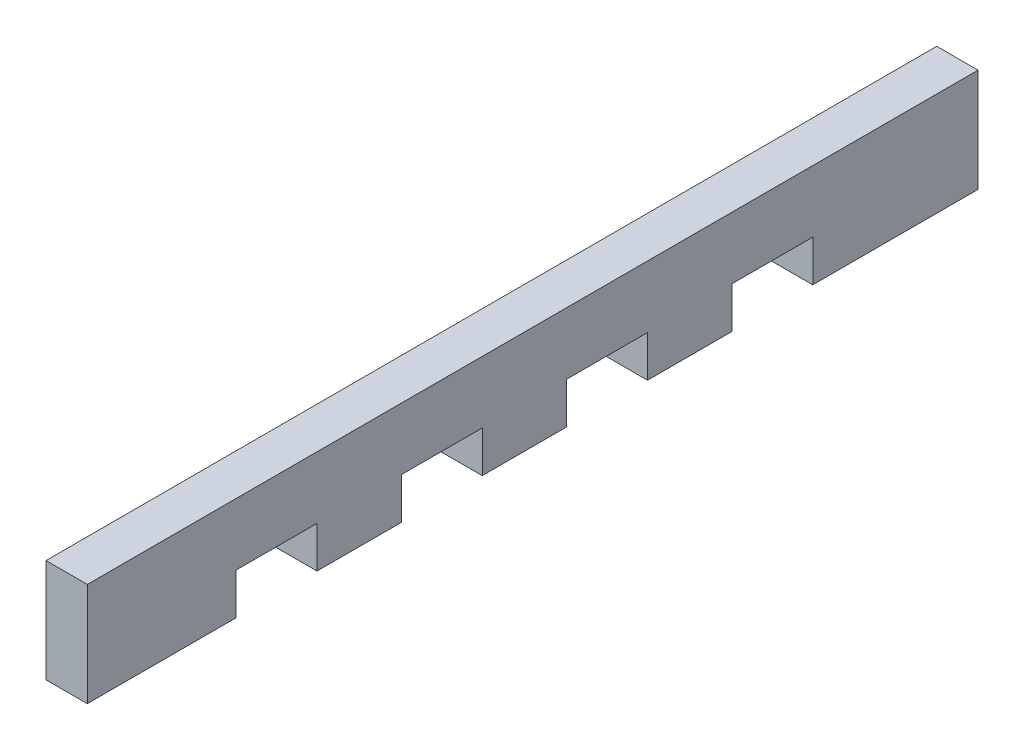
ISO-10303-21;
HEADER;
FILE_DESCRIPTION(('STEP AP214'),'2;1');
FILE_NAME('part.step','',(''),(''),'','','');
FILE_SCHEMA(('AUTOMOTIVE_DESIGN { 1 0 10303 214 1 1 1 1 }'));
ENDSEC;
DATA;
#1=APPLICATION_CONTEXT('core data for automotive mechanical design processes');
#2=APPLICATION_PROTOCOL_DEFINITION('international standard','automotive_design',2000,#1);
#3=PRODUCT_CONTEXT('',#1,'mechanical');
#4=PRODUCT('Part','Part','',(#3));
#5=PRODUCT_RELATED_PRODUCT_CATEGORY('part','',(#4));
#6=PRODUCT_DEFINITION_FORMATION('','',#4);
#7=PRODUCT_DEFINITION_CONTEXT('part definition',#1,'design');
#8=PRODUCT_DEFINITION('design','',#6,#7);
#9=PRODUCT_DEFINITION_SHAPE('','',#8);
#10=(LENGTH_UNIT() NAMED_UNIT(*) SI_UNIT(.MILLI.,.METRE.));
#11=(NAMED_UNIT(*) PLANE_ANGLE_UNIT() SI_UNIT($,.RADIAN.));
#12=(NAMED_UNIT(*) SI_UNIT($,.STERADIAN.) SOLID_ANGLE_UNIT());
#13=UNCERTAINTY_MEASURE_WITH_UNIT(LENGTH_MEASURE(1.E-05),#10,'distance_accuracy_value','');
#14=(GEOMETRIC_REPRESENTATION_CONTEXT(3) GLOBAL_UNCERTAINTY_ASSIGNED_CONTEXT((#13)) GLOBAL_UNIT_ASSIGNED_CONTEXT((#10,
#11,#12)) REPRESENTATION_CONTEXT('',''));
#15=CARTESIAN_POINT('',(0.,0.,0.));
#16=DIRECTION('',(0.,0.,1.));
#17=DIRECTION('',(1.,0.,0.));
#18=AXIS2_PLACEMENT_3D('',#15,#16,#17);
#19=CARTESIAN_POINT('',(6.35,15.875,0.));
#20=DIRECTION('',(0.,0.,-1.));
#21=DIRECTION('',(0.,1.,0.));
#22=AXIS2_PLACEMENT_3D('',#19,#20,#21);
#23=PLANE('',#22);
#24=DIRECTION('',(0.,-1.,0.));
#25=VECTOR('',#24,1.);
#26=CARTESIAN_POINT('',(0.,15.875,0.));
#27=LINE('',#26,#25);
#28=CARTESIAN_POINT('',(0.,15.875,0.));
#29=VERTEX_POINT('',#28);
#30=CARTESIAN_POINT('',(0.,0.,0.));
#31=VERTEX_POINT('',#30);
#32=EDGE_CURVE('E203',#29,#31,#27,.T.);
#33=ORIENTED_EDGE('',*,*,#32,.T.);
#34=DIRECTION('',(-1.,0.,0.));
#35=VECTOR('',#34,1.);
#36=CARTESIAN_POINT('',(6.35,0.,0.));
#37=LINE('',#36,#35);
#38=CARTESIAN_POINT('',(6.35,0.,0.));
#39=VERTEX_POINT('',#38);
#40=EDGE_CURVE('E11',#39,#31,#37,.T.);
#41=ORIENTED_EDGE('',*,*,#40,.F.);
#42=DIRECTION('',(0.,-1.,0.));
#43=VECTOR('',#42,1.);
#44=CARTESIAN_POINT('',(6.35,15.875,0.));
#45=LINE('',#44,#43);
#46=CARTESIAN_POINT('',(6.35,15.875,0.));
#47=VERTEX_POINT('',#46);
#48=EDGE_CURVE('E241',#47,#39,#45,.T.);
#49=ORIENTED_EDGE('',*,*,#48,.F.);
#50=DIRECTION('',(-1.,0.,0.));
#51=VECTOR('',#50,1.);
#52=CARTESIAN_POINT('',(6.35,15.875,0.));
#53=LINE('',#52,#51);
#54=EDGE_CURVE('E199',#47,#29,#53,.T.);
#55=ORIENTED_EDGE('',*,*,#54,.T.);
#56=EDGE_LOOP('',(#33,#41,#49,#55));
#57=FACE_BOUND('',#56,.T.);
#58=ADVANCED_FACE('F35',(#57),#23,.F.);
#59=CARTESIAN_POINT('',(6.35,0.,0.));
#60=DIRECTION('',(0.,1.,0.));
#61=DIRECTION('',(0.,0.,1.));
#62=AXIS2_PLACEMENT_3D('',#59,#60,#61);
#63=PLANE('',#62);
#64=DIRECTION('',(0.,0.,-1.));
#65=VECTOR('',#64,1.);
#66=CARTESIAN_POINT('',(0.,0.,0.));
#67=LINE('',#66,#65);
#68=CARTESIAN_POINT('',(0.,0.,-22.86));
#69=VERTEX_POINT('',#68);
#70=EDGE_CURVE('E206',#31,#69,#67,.T.);
#71=ORIENTED_EDGE('',*,*,#70,.T.);
#72=DIRECTION('',(-1.,0.,0.));
#73=VECTOR('',#72,1.);
#74=CARTESIAN_POINT('',(6.35,0.,-22.86));
#75=LINE('',#74,#73);
#76=CARTESIAN_POINT('',(6.35,0.,-22.86));
#77=VERTEX_POINT('',#76);
#78=EDGE_CURVE('E43',#77,#69,#75,.T.);
#79=ORIENTED_EDGE('',*,*,#78,.F.);
#80=DIRECTION('',(0.,0.,-1.));
#81=VECTOR('',#80,1.);
#82=CARTESIAN_POINT('',(6.35,0.,0.));
#83=LINE('',#82,#81);
#84=EDGE_CURVE('E130',#39,#77,#83,.T.);
#85=ORIENTED_EDGE('',*,*,#84,.F.);
#86=ORIENTED_EDGE('',*,*,#40,.T.);
#87=EDGE_LOOP('',(#71,#79,#85,#86));
#88=FACE_BOUND('',#87,.T.);
#89=ADVANCED_FACE('F359',(#88),#63,.F.);
#90=CARTESIAN_POINT('',(6.35,0.,-22.86));
#91=DIRECTION('',(0.,0.,1.));
#92=DIRECTION('',(1.,0.,0.));
#93=AXIS2_PLACEMENT_3D('',#90,#91,#92);
#94=PLANE('',#93);
#95=DIRECTION('',(0.,1.,0.));
#96=VECTOR('',#95,1.);
#97=CARTESIAN_POINT('',(0.,0.,-22.86));
#98=LINE('',#97,#96);
#99=CARTESIAN_POINT('',(0.,6.35,-22.86));
#100=VERTEX_POINT('',#99);
#101=EDGE_CURVE('E208',#69,#100,#98,.T.);
#102=ORIENTED_EDGE('',*,*,#101,.T.);
#103=DIRECTION('',(-1.,0.,0.));
#104=VECTOR('',#103,1.);
#105=CARTESIAN_POINT('',(6.35,6.35,-22.86));
#106=LINE('',#105,#104);
#107=CARTESIAN_POINT('',(6.35,6.35,-22.86));
#108=VERTEX_POINT('',#107);
#109=EDGE_CURVE('E284',#108,#100,#106,.T.);
#110=ORIENTED_EDGE('',*,*,#109,.F.);
#111=DIRECTION('',(0.,1.,0.));
#112=VECTOR('',#111,1.);
#113=CARTESIAN_POINT('',(6.35,0.,-22.86));
#114=LINE('',#113,#112);
#115=EDGE_CURVE('E292',#77,#108,#114,.T.);
#116=ORIENTED_EDGE('',*,*,#115,.F.);
#117=ORIENTED_EDGE('',*,*,#78,.T.);
#118=EDGE_LOOP('',(#102,#110,#116,#117));
#119=FACE_BOUND('',#118,.T.);
#120=ADVANCED_FACE('F290',(#119),#94,.F.);
#121=CARTESIAN_POINT('',(6.35,6.35,-22.86));
#122=DIRECTION('',(0.,1.,0.));
#123=DIRECTION('',(0.,0.,1.));
#124=AXIS2_PLACEMENT_3D('',#121,#122,#123);
#125=PLANE('',#124);
#126=DIRECTION('',(0.,0.,-1.));
#127=VECTOR('',#126,1.);
#128=CARTESIAN_POINT('',(0.,6.35,-22.86));
#129=LINE('',#128,#127);
#130=CARTESIAN_POINT('',(0.,6.35,-35.306));
#131=VERTEX_POINT('',#130);
#132=EDGE_CURVE('E210',#100,#131,#129,.T.);
#133=ORIENTED_EDGE('',*,*,#132,.T.);
#134=DIRECTION('',(-1.,0.,0.));
#135=VECTOR('',#134,1.);
#136=CARTESIAN_POINT('',(6.35,6.35,-35.306));
#137=LINE('',#136,#135);
#138=CARTESIAN_POINT('',(6.35,6.35,-35.306));
#139=VERTEX_POINT('',#138);
#140=EDGE_CURVE('E281',#139,#131,#137,.T.);
#141=ORIENTED_EDGE('',*,*,#140,.F.);
#142=DIRECTION('',(0.,0.,-1.));
#143=VECTOR('',#142,1.);
#144=CARTESIAN_POINT('',(6.35,6.35,-22.86));
#145=LINE('',#144,#143);
#146=EDGE_CURVE('E310',#108,#139,#145,.T.);
#147=ORIENTED_EDGE('',*,*,#146,.F.);
#148=ORIENTED_EDGE('',*,*,#109,.T.);
#149=EDGE_LOOP('',(#133,#141,#147,#148));
#150=FACE_BOUND('',#149,.T.);
#151=ADVANCED_FACE('F301',(#150),#125,.F.);
#152=CARTESIAN_POINT('',(6.35,6.35,-35.306));
#153=DIRECTION('',(0.,0.,-1.));
#154=DIRECTION('',(-1.,0.,0.));
#155=AXIS2_PLACEMENT_3D('',#152,#153,#154);
#156=PLANE('',#155);
#157=DIRECTION('',(0.,-1.,0.));
#158=VECTOR('',#157,1.);
#159=CARTESIAN_POINT('',(0.,6.35,-35.306));
#160=LINE('',#159,#158);
#161=CARTESIAN_POINT('',(0.,0.,-35.306));
#162=VERTEX_POINT('',#161);
#163=EDGE_CURVE('E212',#131,#162,#160,.T.);
#164=ORIENTED_EDGE('',*,*,#163,.T.);
#165=DIRECTION('',(-1.,0.,0.));
#166=VECTOR('',#165,1.);
#167=CARTESIAN_POINT('',(6.35,0.,-35.306));
#168=LINE('',#167,#166);
#169=CARTESIAN_POINT('',(6.35,0.,-35.306));
#170=VERTEX_POINT('',#169);
#171=EDGE_CURVE('E278',#170,#162,#168,.T.);
#172=ORIENTED_EDGE('',*,*,#171,.F.);
#173=DIRECTION('',(0.,-1.,0.));
#174=VECTOR('',#173,1.);
#175=CARTESIAN_POINT('',(6.35,6.35,-35.306));
#176=LINE('',#175,#174);
#177=EDGE_CURVE('E307',#139,#170,#176,.T.);
#178=ORIENTED_EDGE('',*,*,#177,.F.);
#179=ORIENTED_EDGE('',*,*,#140,.T.);
#180=EDGE_LOOP('',(#164,#172,#178,#179));
#181=FACE_BOUND('',#180,.T.);
#182=ADVANCED_FACE('F305',(#181),#156,.F.);
#183=CARTESIAN_POINT('',(6.35,0.,-35.306));
#184=DIRECTION('',(0.,1.,0.));
#185=DIRECTION('',(0.,0.,1.));
#186=AXIS2_PLACEMENT_3D('',#183,#184,#185);
#187=PLANE('',#186);
#188=DIRECTION('',(0.,0.,-1.));
#189=VECTOR('',#188,1.);
#190=CARTESIAN_POINT('',(0.,0.,-35.306));
#191=LINE('',#190,#189);
#192=CARTESIAN_POINT('',(0.,0.,-48.26));
#193=VERTEX_POINT('',#192);
#194=EDGE_CURVE('E214',#162,#193,#191,.T.);
#195=ORIENTED_EDGE('',*,*,#194,.T.);
#196=DIRECTION('',(-1.,0.,0.));
#197=VECTOR('',#196,1.);
#198=CARTESIAN_POINT('',(6.35,0.,-48.26));
#199=LINE('',#198,#197);
#200=CARTESIAN_POINT('',(6.35,0.,-48.26));
#201=VERTEX_POINT('',#200);
#202=EDGE_CURVE('E275',#201,#193,#199,.T.);
#203=ORIENTED_EDGE('',*,*,#202,.F.);
#204=DIRECTION('',(0.,0.,-1.));
#205=VECTOR('',#204,1.);
#206=CARTESIAN_POINT('',(6.35,0.,-35.306));
#207=LINE('',#206,#205);
#208=EDGE_CURVE('E309',#170,#201,#207,.T.);
#209=ORIENTED_EDGE('',*,*,#208,.F.);
#210=ORIENTED_EDGE('',*,*,#171,.T.);
#211=EDGE_LOOP('',(#195,#203,#209,#210));
#212=FACE_BOUND('',#211,.T.);
#213=ADVANCED_FACE('F372',(#212),#187,.F.);
#214=CARTESIAN_POINT('',(6.35,0.,-48.26));
#215=DIRECTION('',(0.,0.,1.));
#216=DIRECTION('',(1.,0.,0.));
#217=AXIS2_PLACEMENT_3D('',#214,#215,#216);
#218=PLANE('',#217);
#219=DIRECTION('',(0.,1.,0.));
#220=VECTOR('',#219,1.);
#221=CARTESIAN_POINT('',(0.,0.,-48.26));
#222=LINE('',#221,#220);
#223=CARTESIAN_POINT('',(0.,6.35,-48.26));
#224=VERTEX_POINT('',#223);
#225=EDGE_CURVE('E216',#193,#224,#222,.T.);
#226=ORIENTED_EDGE('',*,*,#225,.T.);
#227=DIRECTION('',(-1.,0.,0.));
#228=VECTOR('',#227,1.);
#229=CARTESIAN_POINT('',(6.35,6.35,-48.26));
#230=LINE('',#229,#228);
#231=CARTESIAN_POINT('',(6.35,6.35,-48.26));
#232=VERTEX_POINT('',#231);
#233=EDGE_CURVE('E272',#232,#224,#230,.T.);
#234=ORIENTED_EDGE('',*,*,#233,.F.);
#235=DIRECTION('',(0.,1.,0.));
#236=VECTOR('',#235,1.);
#237=CARTESIAN_POINT('',(6.35,0.,-48.26));
#238=LINE('',#237,#236);
#239=EDGE_CURVE('E312',#201,#232,#238,.T.);
#240=ORIENTED_EDGE('',*,*,#239,.F.);
#241=ORIENTED_EDGE('',*,*,#202,.T.);
#242=EDGE_LOOP('',(#226,#234,#240,#241));
#243=FACE_BOUND('',#242,.T.);
#244=ADVANCED_FACE('F375',(#243),#218,.F.);
#245=CARTESIAN_POINT('',(6.35,6.35,-48.26));
#246=DIRECTION('',(0.,1.,0.));
#247=DIRECTION('',(0.,0.,1.));
#248=AXIS2_PLACEMENT_3D('',#245,#246,#247);
#249=PLANE('',#248);
#250=DIRECTION('',(0.,0.,-1.));
#251=VECTOR('',#250,1.);
#252=CARTESIAN_POINT('',(0.,6.35,-48.26));
#253=LINE('',#252,#251);
#254=CARTESIAN_POINT('',(0.,6.35,-60.706));
#255=VERTEX_POINT('',#254);
#256=EDGE_CURVE('E218',#224,#255,#253,.T.);
#257=ORIENTED_EDGE('',*,*,#256,.T.);
#258=DIRECTION('',(-1.,0.,0.));
#259=VECTOR('',#258,1.);
#260=CARTESIAN_POINT('',(6.35,6.35,-60.706));
#261=LINE('',#260,#259);
#262=CARTESIAN_POINT('',(6.35,6.35,-60.706));
#263=VERTEX_POINT('',#262);
#264=EDGE_CURVE('E269',#263,#255,#261,.T.);
#265=ORIENTED_EDGE('',*,*,#264,.F.);
#266=DIRECTION('',(0.,0.,-1.));
#267=VECTOR('',#266,1.);
#268=CARTESIAN_POINT('',(6.35,6.35,-48.26));
#269=LINE('',#268,#267);
#270=EDGE_CURVE('E318',#232,#263,#269,.T.);
#271=ORIENTED_EDGE('',*,*,#270,.F.);
#272=ORIENTED_EDGE('',*,*,#233,.T.);
#273=EDGE_LOOP('',(#257,#265,#271,#272));
#274=FACE_BOUND('',#273,.T.);
#275=ADVANCED_FACE('F379',(#274),#249,.F.);
#276=CARTESIAN_POINT('',(6.35,6.35,-60.706));
#277=DIRECTION('',(0.,0.,-1.));
#278=DIRECTION('',(-1.,0.,0.));
#279=AXIS2_PLACEMENT_3D('',#276,#277,#278);
#280=PLANE('',#279);
#281=DIRECTION('',(0.,-1.,0.));
#282=VECTOR('',#281,1.);
#283=CARTESIAN_POINT('',(0.,6.35,-60.706));
#284=LINE('',#283,#282);
#285=CARTESIAN_POINT('',(0.,0.,-60.706));
#286=VERTEX_POINT('',#285);
#287=EDGE_CURVE('E220',#255,#286,#284,.T.);
#288=ORIENTED_EDGE('',*,*,#287,.T.);
#289=DIRECTION('',(-1.,0.,0.));
#290=VECTOR('',#289,1.);
#291=CARTESIAN_POINT('',(6.35,0.,-60.706));
#292=LINE('',#291,#290);
#293=CARTESIAN_POINT('',(6.35,0.,-60.706));
#294=VERTEX_POINT('',#293);
#295=EDGE_CURVE('E266',#294,#286,#292,.T.);
#296=ORIENTED_EDGE('',*,*,#295,.F.);
#297=DIRECTION('',(0.,-1.,0.));
#298=VECTOR('',#297,1.);
#299=CARTESIAN_POINT('',(6.35,6.35,-60.706));
#300=LINE('',#299,#298);
#301=EDGE_CURVE('E320',#263,#294,#300,.T.);
#302=ORIENTED_EDGE('',*,*,#301,.F.);
#303=ORIENTED_EDGE('',*,*,#264,.T.);
#304=EDGE_LOOP('',(#288,#296,#302,#303));
#305=FACE_BOUND('',#304,.T.);
#306=ADVANCED_FACE('F383',(#305),#280,.F.);
#307=CARTESIAN_POINT('',(6.35,0.,-60.706));
#308=DIRECTION('',(0.,1.,0.));
#309=DIRECTION('',(0.,0.,1.));
#310=AXIS2_PLACEMENT_3D('',#307,#308,#309);
#311=PLANE('',#310);
#312=DIRECTION('',(0.,0.,-1.));
#313=VECTOR('',#312,1.);
#314=CARTESIAN_POINT('',(0.,0.,-60.706));
#315=LINE('',#314,#313);
#316=CARTESIAN_POINT('',(0.,0.,-73.66));
#317=VERTEX_POINT('',#316);
#318=EDGE_CURVE('E222',#286,#317,#315,.T.);
#319=ORIENTED_EDGE('',*,*,#318,.T.);
#320=DIRECTION('',(-1.,0.,0.));
#321=VECTOR('',#320,1.);
#322=CARTESIAN_POINT('',(6.35,0.,-73.66));
#323=LINE('',#322,#321);
#324=CARTESIAN_POINT('',(6.35,0.,-73.66));
#325=VERTEX_POINT('',#324);
#326=EDGE_CURVE('E263',#325,#317,#323,.T.);
#327=ORIENTED_EDGE('',*,*,#326,.F.);
#328=DIRECTION('',(0.,0.,-1.));
#329=VECTOR('',#328,1.);
#330=CARTESIAN_POINT('',(6.35,0.,-60.706));
#331=LINE('',#330,#329);
#332=EDGE_CURVE('E322',#294,#325,#331,.T.);
#333=ORIENTED_EDGE('',*,*,#332,.F.);
#334=ORIENTED_EDGE('',*,*,#295,.T.);
#335=EDGE_LOOP('',(#319,#327,#333,#334));
#336=FACE_BOUND('',#335,.T.);
#337=ADVANCED_FACE('F387',(#336),#311,.F.);
#338=CARTESIAN_POINT('',(6.35,0.,-73.66));
#339=DIRECTION('',(0.,0.,1.));
#340=DIRECTION('',(1.,0.,0.));
#341=AXIS2_PLACEMENT_3D('',#338,#339,#340);
#342=PLANE('',#341);
#343=DIRECTION('',(0.,1.,0.));
#344=VECTOR('',#343,1.);
#345=CARTESIAN_POINT('',(0.,0.,-73.66));
#346=LINE('',#345,#344);
#347=CARTESIAN_POINT('',(0.,6.35,-73.66));
#348=VERTEX_POINT('',#347);
#349=EDGE_CURVE('E224',#317,#348,#346,.T.);
#350=ORIENTED_EDGE('',*,*,#349,.T.);
#351=DIRECTION('',(-1.,0.,0.));
#352=VECTOR('',#351,1.);
#353=CARTESIAN_POINT('',(6.35,6.35,-73.66));
#354=LINE('',#353,#352);
#355=CARTESIAN_POINT('',(6.35,6.35,-73.66));
#356=VERTEX_POINT('',#355);
#357=EDGE_CURVE('E260',#356,#348,#354,.T.);
#358=ORIENTED_EDGE('',*,*,#357,.F.);
#359=DIRECTION('',(0.,1.,0.));
#360=VECTOR('',#359,1.);
#361=CARTESIAN_POINT('',(6.35,0.,-73.66));
#362=LINE('',#361,#360);
#363=EDGE_CURVE('E324',#325,#356,#362,.T.);
#364=ORIENTED_EDGE('',*,*,#363,.F.);
#365=ORIENTED_EDGE('',*,*,#326,.T.);
#366=EDGE_LOOP('',(#350,#358,#364,#365));
#367=FACE_BOUND('',#366,.T.);
#368=ADVANCED_FACE('F391',(#367),#342,.F.);
#369=CARTESIAN_POINT('',(6.35,6.35,-73.66));
#370=DIRECTION('',(0.,1.,0.));
#371=DIRECTION('',(0.,0.,1.));
#372=AXIS2_PLACEMENT_3D('',#369,#370,#371);
#373=PLANE('',#372);
#374=DIRECTION('',(0.,0.,-1.));
#375=VECTOR('',#374,1.);
#376=CARTESIAN_POINT('',(0.,6.35,-73.66));
#377=LINE('',#376,#375);
#378=CARTESIAN_POINT('',(0.,6.35,-86.106));
#379=VERTEX_POINT('',#378);
#380=EDGE_CURVE('E226',#348,#379,#377,.T.);
#381=ORIENTED_EDGE('',*,*,#380,.T.);
#382=DIRECTION('',(-1.,0.,0.));
#383=VECTOR('',#382,1.);
#384=CARTESIAN_POINT('',(6.35,6.35,-86.106));
#385=LINE('',#384,#383);
#386=CARTESIAN_POINT('',(6.35,6.35,-86.106));
#387=VERTEX_POINT('',#386);
#388=EDGE_CURVE('E257',#387,#379,#385,.T.);
#389=ORIENTED_EDGE('',*,*,#388,.F.);
#390=DIRECTION('',(0.,0.,-1.));
#391=VECTOR('',#390,1.);
#392=CARTESIAN_POINT('',(6.35,6.35,-73.66));
#393=LINE('',#392,#391);
#394=EDGE_CURVE('E326',#356,#387,#393,.T.);
#395=ORIENTED_EDGE('',*,*,#394,.F.);
#396=ORIENTED_EDGE('',*,*,#357,.T.);
#397=EDGE_LOOP('',(#381,#389,#395,#396));
#398=FACE_BOUND('',#397,.T.);
#399=ADVANCED_FACE('F395',(#398),#373,.F.);
#400=CARTESIAN_POINT('',(6.35,6.35,-86.106));
#401=DIRECTION('',(0.,0.,-1.));
#402=DIRECTION('',(-1.,0.,0.));
#403=AXIS2_PLACEMENT_3D('',#400,#401,#402);
#404=PLANE('',#403);
#405=DIRECTION('',(0.,-1.,0.));
#406=VECTOR('',#405,1.);
#407=CARTESIAN_POINT('',(0.,6.35,-86.106));
#408=LINE('',#407,#406);
#409=CARTESIAN_POINT('',(0.,0.,-86.106));
#410=VERTEX_POINT('',#409);
#411=EDGE_CURVE('E228',#379,#410,#408,.T.);
#412=ORIENTED_EDGE('',*,*,#411,.T.);
#413=DIRECTION('',(-1.,0.,0.));
#414=VECTOR('',#413,1.);
#415=CARTESIAN_POINT('',(6.35,0.,-86.106));
#416=LINE('',#415,#414);
#417=CARTESIAN_POINT('',(6.35,0.,-86.106));
#418=VERTEX_POINT('',#417);
#419=EDGE_CURVE('E254',#418,#410,#416,.T.);
#420=ORIENTED_EDGE('',*,*,#419,.F.);
#421=DIRECTION('',(0.,-1.,0.));
#422=VECTOR('',#421,1.);
#423=CARTESIAN_POINT('',(6.35,6.35,-86.106));
#424=LINE('',#423,#422);
#425=EDGE_CURVE('E328',#387,#418,#424,.T.);
#426=ORIENTED_EDGE('',*,*,#425,.F.);
#427=ORIENTED_EDGE('',*,*,#388,.T.);
#428=EDGE_LOOP('',(#412,#420,#426,#427));
#429=FACE_BOUND('',#428,.T.);
#430=ADVANCED_FACE('F399',(#429),#404,.F.);
#431=CARTESIAN_POINT('',(6.35,0.,-86.106));
#432=DIRECTION('',(0.,1.,0.));
#433=DIRECTION('',(0.,0.,1.));
#434=AXIS2_PLACEMENT_3D('',#431,#432,#433);
#435=PLANE('',#434);
#436=DIRECTION('',(0.,0.,-1.));
#437=VECTOR('',#436,1.);
#438=CARTESIAN_POINT('',(0.,0.,-86.106));
#439=LINE('',#438,#437);
#440=CARTESIAN_POINT('',(0.,0.,-99.06));
#441=VERTEX_POINT('',#440);
#442=EDGE_CURVE('E230',#410,#441,#439,.T.);
#443=ORIENTED_EDGE('',*,*,#442,.T.);
#444=DIRECTION('',(-1.,0.,0.));
#445=VECTOR('',#444,1.);
#446=CARTESIAN_POINT('',(6.35,0.,-99.06));
#447=LINE('',#446,#445);
#448=CARTESIAN_POINT('',(6.35,0.,-99.06));
#449=VERTEX_POINT('',#448);
#450=EDGE_CURVE('E251',#449,#441,#447,.T.);
#451=ORIENTED_EDGE('',*,*,#450,.F.);
#452=DIRECTION('',(0.,0.,-1.));
#453=VECTOR('',#452,1.);
#454=CARTESIAN_POINT('',(6.35,0.,-86.106));
#455=LINE('',#454,#453);
#456=EDGE_CURVE('E330',#418,#449,#455,.T.);
#457=ORIENTED_EDGE('',*,*,#456,.F.);
#458=ORIENTED_EDGE('',*,*,#419,.T.);
#459=EDGE_LOOP('',(#443,#451,#457,#458));
#460=FACE_BOUND('',#459,.T.);
#461=ADVANCED_FACE('F403',(#460),#435,.F.);
#462=CARTESIAN_POINT('',(6.35,0.,-99.06));
#463=DIRECTION('',(0.,0.,1.));
#464=DIRECTION('',(0.,-1.,0.));
#465=AXIS2_PLACEMENT_3D('',#462,#463,#464);
#466=PLANE('',#465);
#467=DIRECTION('',(0.,1.,0.));
#468=VECTOR('',#467,1.);
#469=CARTESIAN_POINT('',(0.,0.,-99.06));
#470=LINE('',#469,#468);
#471=CARTESIAN_POINT('',(0.,6.35,-99.06));
#472=VERTEX_POINT('',#471);
#473=EDGE_CURVE('E232',#441,#472,#470,.T.);
#474=ORIENTED_EDGE('',*,*,#473,.T.);
#475=DIRECTION('',(-1.,0.,0.));
#476=VECTOR('',#475,1.);
#477=CARTESIAN_POINT('',(6.35,6.35,-99.06));
#478=LINE('',#477,#476);
#479=CARTESIAN_POINT('',(6.35,6.35,-99.06));
#480=VERTEX_POINT('',#479);
#481=EDGE_CURVE('E248',#480,#472,#478,.T.);
#482=ORIENTED_EDGE('',*,*,#481,.F.);
#483=DIRECTION('',(0.,1.,0.));
#484=VECTOR('',#483,1.);
#485=CARTESIAN_POINT('',(6.35,0.,-99.06));
#486=LINE('',#485,#484);
#487=EDGE_CURVE('E332',#449,#480,#486,.T.);
#488=ORIENTED_EDGE('',*,*,#487,.F.);
#489=ORIENTED_EDGE('',*,*,#450,.T.);
#490=EDGE_LOOP('',(#474,#482,#488,#489));
#491=FACE_BOUND('',#490,.T.);
#492=ADVANCED_FACE('F407',(#491),#466,.F.);
#493=CARTESIAN_POINT('',(6.35,6.35,-99.06));
#494=DIRECTION('',(0.,1.,0.));
#495=DIRECTION('',(0.,0.,1.));
#496=AXIS2_PLACEMENT_3D('',#493,#494,#495);
#497=PLANE('',#496);
#498=DIRECTION('',(0.,0.,-1.));
#499=VECTOR('',#498,1.);
#500=CARTESIAN_POINT('',(0.,6.35,-99.06));
#501=LINE('',#500,#499);
#502=CARTESIAN_POINT('',(0.,6.35,-111.506));
#503=VERTEX_POINT('',#502);
#504=EDGE_CURVE('E234',#472,#503,#501,.T.);
#505=ORIENTED_EDGE('',*,*,#504,.T.);
#506=DIRECTION('',(-1.,0.,0.));
#507=VECTOR('',#506,1.);
#508=CARTESIAN_POINT('',(6.35,6.35,-111.506));
#509=LINE('',#508,#507);
#510=CARTESIAN_POINT('',(6.35,6.35,-111.506));
#511=VERTEX_POINT('',#510);
#512=EDGE_CURVE('E245',#511,#503,#509,.T.);
#513=ORIENTED_EDGE('',*,*,#512,.F.);
#514=DIRECTION('',(0.,0.,-1.));
#515=VECTOR('',#514,1.);
#516=CARTESIAN_POINT('',(6.35,6.35,-99.06));
#517=LINE('',#516,#515);
#518=EDGE_CURVE('E334',#480,#511,#517,.T.);
#519=ORIENTED_EDGE('',*,*,#518,.F.);
#520=ORIENTED_EDGE('',*,*,#481,.T.);
#521=EDGE_LOOP('',(#505,#513,#519,#520));
#522=FACE_BOUND('',#521,.T.);
#523=ADVANCED_FACE('F340',(#522),#497,.F.);
#524=CARTESIAN_POINT('',(6.35,6.35,-111.506));
#525=DIRECTION('',(0.,0.,-1.));
#526=DIRECTION('',(-1.,0.,0.));
#527=AXIS2_PLACEMENT_3D('',#524,#525,#526);
#528=PLANE('',#527);
#529=DIRECTION('',(0.,-1.,0.));
#530=VECTOR('',#529,1.);
#531=CARTESIAN_POINT('',(0.,6.35,-111.506));
#532=LINE('',#531,#530);
#533=CARTESIAN_POINT('',(0.,0.,-111.506));
#534=VERTEX_POINT('',#533);
#535=EDGE_CURVE('E236',#503,#534,#532,.T.);
#536=ORIENTED_EDGE('',*,*,#535,.T.);
#537=DIRECTION('',(-1.,0.,0.));
#538=VECTOR('',#537,1.);
#539=CARTESIAN_POINT('',(6.35,0.,-111.506));
#540=LINE('',#539,#538);
#541=CARTESIAN_POINT('',(6.35,0.,-111.506));
#542=VERTEX_POINT('',#541);
#543=EDGE_CURVE('E194',#542,#534,#540,.T.);
#544=ORIENTED_EDGE('',*,*,#543,.F.);
#545=DIRECTION('',(0.,-1.,0.));
#546=VECTOR('',#545,1.);
#547=CARTESIAN_POINT('',(6.35,6.35,-111.506));
#548=LINE('',#547,#546);
#549=EDGE_CURVE('E185',#511,#542,#548,.T.);
#550=ORIENTED_EDGE('',*,*,#549,.F.);
#551=ORIENTED_EDGE('',*,*,#512,.T.);
#552=EDGE_LOOP('',(#536,#544,#550,#551));
#553=FACE_BOUND('',#552,.T.);
#554=ADVANCED_FACE('F344',(#553),#528,.F.);
#555=CARTESIAN_POINT('',(6.35,0.,-111.506));
#556=DIRECTION('',(0.,1.,0.));
#557=DIRECTION('',(0.,0.,1.));
#558=AXIS2_PLACEMENT_3D('',#555,#556,#557);
#559=PLANE('',#558);
#560=DIRECTION('',(0.,0.,-1.));
#561=VECTOR('',#560,1.);
#562=CARTESIAN_POINT('',(0.,0.,-111.506));
#563=LINE('',#562,#561);
#564=CARTESIAN_POINT('',(0.,0.,-136.906));
#565=VERTEX_POINT('',#564);
#566=EDGE_CURVE('E193',#534,#565,#563,.T.);
#567=ORIENTED_EDGE('',*,*,#566,.T.);
#568=DIRECTION('',(-1.,0.,0.));
#569=VECTOR('',#568,1.);
#570=CARTESIAN_POINT('',(6.35,0.,-136.906));
#571=LINE('',#570,#569);
#572=CARTESIAN_POINT('',(6.35,0.,-136.906));
#573=VERTEX_POINT('',#572);
#574=EDGE_CURVE('E190',#573,#565,#571,.T.);
#575=ORIENTED_EDGE('',*,*,#574,.F.);
#576=DIRECTION('',(0.,0.,-1.));
#577=VECTOR('',#576,1.);
#578=CARTESIAN_POINT('',(6.35,0.,-111.506));
#579=LINE('',#578,#577);
#580=EDGE_CURVE('E179',#542,#573,#579,.T.);
#581=ORIENTED_EDGE('',*,*,#580,.F.);
#582=ORIENTED_EDGE('',*,*,#543,.T.);
#583=EDGE_LOOP('',(#567,#575,#581,#582));
#584=FACE_BOUND('',#583,.T.);
#585=ADVANCED_FACE('F191',(#584),#559,.F.);
#586=CARTESIAN_POINT('',(6.35,0.,-136.906));
#587=DIRECTION('',(0.,0.,1.));
#588=DIRECTION('',(1.,0.,0.));
#589=AXIS2_PLACEMENT_3D('',#586,#587,#588);
#590=PLANE('',#589);
#591=DIRECTION('',(0.,1.,0.));
#592=VECTOR('',#591,1.);
#593=CARTESIAN_POINT('',(0.,0.,-136.906));
#594=LINE('',#593,#592);
#595=CARTESIAN_POINT('',(0.,15.875,-136.906));
#596=VERTEX_POINT('',#595);
#597=EDGE_CURVE('E116',#565,#596,#594,.T.);
#598=ORIENTED_EDGE('',*,*,#597,.T.);
#599=DIRECTION('',(-1.,0.,0.));
#600=VECTOR('',#599,1.);
#601=CARTESIAN_POINT('',(6.35,15.875,-136.906));
#602=LINE('',#601,#600);
#603=CARTESIAN_POINT('',(6.35,15.875,-136.906));
#604=VERTEX_POINT('',#603);
#605=EDGE_CURVE('E195',#604,#596,#602,.T.);
#606=ORIENTED_EDGE('',*,*,#605,.F.);
#607=DIRECTION('',(0.,1.,0.));
#608=VECTOR('',#607,1.);
#609=CARTESIAN_POINT('',(6.35,0.,-136.906));
#610=LINE('',#609,#608);
#611=EDGE_CURVE('E183',#573,#604,#610,.T.);
#612=ORIENTED_EDGE('',*,*,#611,.F.);
#613=ORIENTED_EDGE('',*,*,#574,.T.);
#614=EDGE_LOOP('',(#598,#606,#612,#613));
#615=FACE_BOUND('',#614,.T.);
#616=ADVANCED_FACE('F197',(#615),#590,.F.);
#617=CARTESIAN_POINT('',(6.35,15.875,-136.906));
#618=DIRECTION('',(0.,-1.,0.));
#619=DIRECTION('',(0.,0.,-1.));
#620=AXIS2_PLACEMENT_3D('',#617,#618,#619);
#621=PLANE('',#620);
#622=DIRECTION('',(0.,0.,1.));
#623=VECTOR('',#622,1.);
#624=CARTESIAN_POINT('',(0.,15.875,-136.906));
#625=LINE('',#624,#623);
#626=EDGE_CURVE('E122',#596,#29,#625,.T.);
#627=ORIENTED_EDGE('',*,*,#626,.T.);
#628=ORIENTED_EDGE('',*,*,#54,.F.);
#629=DIRECTION('',(0.,0.,1.));
#630=VECTOR('',#629,1.);
#631=CARTESIAN_POINT('',(6.35,15.875,-136.906));
#632=LINE('',#631,#630);
#633=EDGE_CURVE('E51',#604,#47,#632,.T.);
#634=ORIENTED_EDGE('',*,*,#633,.F.);
#635=ORIENTED_EDGE('',*,*,#605,.T.);
#636=EDGE_LOOP('',(#627,#628,#634,#635));
#637=FACE_BOUND('',#636,.T.);
#638=ADVANCED_FACE('F348',(#637),#621,.F.);
#639=CARTESIAN_POINT('',(6.35,0.,0.));
#640=DIRECTION('',(1.,0.,0.));
#641=DIRECTION('',(0.,0.,-1.));
#642=AXIS2_PLACEMENT_3D('',#639,#640,#641);
#643=PLANE('',#642);
#644=ORIENTED_EDGE('',*,*,#48,.T.);
#645=ORIENTED_EDGE('',*,*,#84,.T.);
#646=ORIENTED_EDGE('',*,*,#115,.T.);
#647=ORIENTED_EDGE('',*,*,#146,.T.);
#648=ORIENTED_EDGE('',*,*,#177,.T.);
#649=ORIENTED_EDGE('',*,*,#208,.T.);
#650=ORIENTED_EDGE('',*,*,#239,.T.);
#651=ORIENTED_EDGE('',*,*,#270,.T.);
#652=ORIENTED_EDGE('',*,*,#301,.T.);
#653=ORIENTED_EDGE('',*,*,#332,.T.);
#654=ORIENTED_EDGE('',*,*,#363,.T.);
#655=ORIENTED_EDGE('',*,*,#394,.T.);
#656=ORIENTED_EDGE('',*,*,#425,.T.);
#657=ORIENTED_EDGE('',*,*,#456,.T.);
#658=ORIENTED_EDGE('',*,*,#487,.T.);
#659=ORIENTED_EDGE('',*,*,#518,.T.);
#660=ORIENTED_EDGE('',*,*,#549,.T.);
#661=ORIENTED_EDGE('',*,*,#580,.T.);
#662=ORIENTED_EDGE('',*,*,#611,.T.);
#663=ORIENTED_EDGE('',*,*,#633,.T.);
#664=EDGE_LOOP('',(#644,#645,#646,#647,#648,#649,#650,#651,#652,#653,#654,#655,#656,#657,#658,
#659,#660,#661,#662,#663));
#665=FACE_BOUND('',#664,.T.);
#666=ADVANCED_FACE('F181',(#665),#643,.T.);
#667=CARTESIAN_POINT('',(0.,0.,0.));
#668=DIRECTION('',(1.,0.,0.));
#669=DIRECTION('',(0.,0.,-1.));
#670=AXIS2_PLACEMENT_3D('',#667,#668,#669);
#671=PLANE('',#670);
#672=ORIENTED_EDGE('',*,*,#32,.F.);
#673=ORIENTED_EDGE('',*,*,#626,.F.);
#674=ORIENTED_EDGE('',*,*,#597,.F.);
#675=ORIENTED_EDGE('',*,*,#566,.F.);
#676=ORIENTED_EDGE('',*,*,#535,.F.);
#677=ORIENTED_EDGE('',*,*,#504,.F.);
#678=ORIENTED_EDGE('',*,*,#473,.F.);
#679=ORIENTED_EDGE('',*,*,#442,.F.);
#680=ORIENTED_EDGE('',*,*,#411,.F.);
#681=ORIENTED_EDGE('',*,*,#380,.F.);
#682=ORIENTED_EDGE('',*,*,#349,.F.);
#683=ORIENTED_EDGE('',*,*,#318,.F.);
#684=ORIENTED_EDGE('',*,*,#287,.F.);
#685=ORIENTED_EDGE('',*,*,#256,.F.);
#686=ORIENTED_EDGE('',*,*,#225,.F.);
#687=ORIENTED_EDGE('',*,*,#194,.F.);
#688=ORIENTED_EDGE('',*,*,#163,.F.);
#689=ORIENTED_EDGE('',*,*,#132,.F.);
#690=ORIENTED_EDGE('',*,*,#101,.F.);
#691=ORIENTED_EDGE('',*,*,#70,.F.);
#692=EDGE_LOOP('',(#672,#673,#674,#675,#676,#677,#678,#679,#680,#681,#682,#683,#684,#685,#686,
#687,#688,#689,#690,#691));
#693=FACE_BOUND('',#692,.T.);
#694=ADVANCED_FACE('F296',(#693),#671,.F.);
#695=CLOSED_SHELL('',(#58,#89,#120,#151,#182,#213,#244,#275,#306,#337,#368,#399,#430,#461,#492,
#523,#554,#585,#616,#638,#666,#694));
#696=MANIFOLD_SOLID_BREP('B2',#695);
#697=ADVANCED_BREP_SHAPE_REPRESENTATION('',(#18,#696),#14);
#698=SHAPE_DEFINITION_REPRESENTATION(#9,#697);
ENDSEC;
END-ISO-10303-21;
